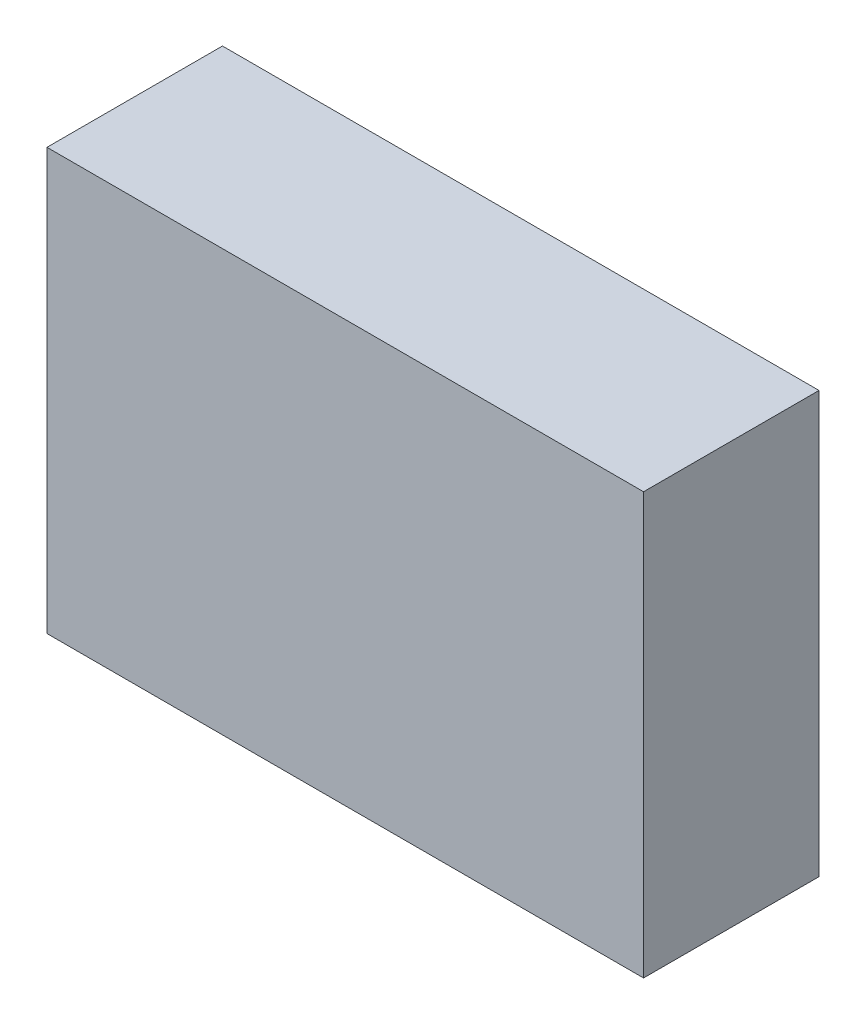
ISO-10303-21;
HEADER;
FILE_DESCRIPTION(('STEP AP214'),'2;1');
FILE_NAME('part.step','',(''),(''),'','','');
FILE_SCHEMA(('AUTOMOTIVE_DESIGN { 1 0 10303 214 1 1 1 1 }'));
ENDSEC;
DATA;
#1=APPLICATION_CONTEXT('core data for automotive mechanical design processes');
#2=APPLICATION_PROTOCOL_DEFINITION('international standard','automotive_design',2000,#1);
#3=PRODUCT_CONTEXT('',#1,'mechanical');
#4=PRODUCT('Part','Part','',(#3));
#5=PRODUCT_RELATED_PRODUCT_CATEGORY('part','',(#4));
#6=PRODUCT_DEFINITION_FORMATION('','',#4);
#7=PRODUCT_DEFINITION_CONTEXT('part definition',#1,'design');
#8=PRODUCT_DEFINITION('design','',#6,#7);
#9=PRODUCT_DEFINITION_SHAPE('','',#8);
#10=(LENGTH_UNIT() NAMED_UNIT(*) SI_UNIT(.MILLI.,.METRE.));
#11=(NAMED_UNIT(*) PLANE_ANGLE_UNIT() SI_UNIT($,.RADIAN.));
#12=(NAMED_UNIT(*) SI_UNIT($,.STERADIAN.) SOLID_ANGLE_UNIT());
#13=UNCERTAINTY_MEASURE_WITH_UNIT(LENGTH_MEASURE(1.E-05),#10,'distance_accuracy_value','');
#14=(GEOMETRIC_REPRESENTATION_CONTEXT(3) GLOBAL_UNCERTAINTY_ASSIGNED_CONTEXT((#13)) GLOBAL_UNIT_ASSIGNED_CONTEXT((#10,
#11,#12)) REPRESENTATION_CONTEXT('',''));
#15=CARTESIAN_POINT('',(0.,0.,0.));
#16=DIRECTION('',(0.,0.,1.));
#17=DIRECTION('',(1.,0.,0.));
#18=AXIS2_PLACEMENT_3D('',#15,#16,#17);
#19=CARTESIAN_POINT('',(2.58,1.13,0.));
#20=DIRECTION('',(1.,0.,0.));
#21=DIRECTION('',(0.,0.,1.));
#22=AXIS2_PLACEMENT_3D('',#19,#20,#21);
#23=PLANE('',#22);
#24=DIRECTION('',(0.,1.,0.));
#25=VECTOR('',#24,1.);
#26=CARTESIAN_POINT('',(2.58,1.13,0.1));
#27=LINE('',#26,#25);
#28=CARTESIAN_POINT('',(2.58,1.13,0.1));
#29=VERTEX_POINT('',#28);
#30=CARTESIAN_POINT('',(2.58,1.37,0.1));
#31=VERTEX_POINT('',#30);
#32=EDGE_CURVE('E11',#29,#31,#27,.T.);
#33=ORIENTED_EDGE('',*,*,#32,.T.);
#34=DIRECTION('',(0.,0.,1.));
#35=VECTOR('',#34,1.);
#36=CARTESIAN_POINT('',(2.58,1.37,0.));
#37=LINE('',#36,#35);
#38=CARTESIAN_POINT('',(2.58,1.37,0.));
#39=VERTEX_POINT('',#38);
#40=EDGE_CURVE('E24',#39,#31,#37,.T.);
#41=ORIENTED_EDGE('',*,*,#40,.F.);
#42=DIRECTION('',(0.,1.,0.));
#43=VECTOR('',#42,1.);
#44=CARTESIAN_POINT('',(2.58,1.13,0.));
#45=LINE('',#44,#43);
#46=CARTESIAN_POINT('',(2.58,1.13,0.));
#47=VERTEX_POINT('',#46);
#48=EDGE_CURVE('E86',#47,#39,#45,.T.);
#49=ORIENTED_EDGE('',*,*,#48,.F.);
#50=DIRECTION('',(0.,0.,1.));
#51=VECTOR('',#50,1.);
#52=CARTESIAN_POINT('',(2.58,1.13,0.));
#53=LINE('',#52,#51);
#54=EDGE_CURVE('E36',#47,#29,#53,.T.);
#55=ORIENTED_EDGE('',*,*,#54,.T.);
#56=EDGE_LOOP('',(#33,#41,#49,#55));
#57=FACE_BOUND('',#56,.T.);
#58=ADVANCED_FACE('F17',(#57),#23,.F.);
#59=CARTESIAN_POINT('',(2.92,1.13,0.));
#60=DIRECTION('',(1.,0.,0.));
#61=DIRECTION('',(0.,0.,1.));
#62=AXIS2_PLACEMENT_3D('',#59,#60,#61);
#63=PLANE('',#62);
#64=DIRECTION('',(0.,0.,1.));
#65=VECTOR('',#64,1.);
#66=CARTESIAN_POINT('',(2.92,1.13,0.));
#67=LINE('',#66,#65);
#68=CARTESIAN_POINT('',(2.92,1.13,0.));
#69=VERTEX_POINT('',#68);
#70=CARTESIAN_POINT('',(2.92,1.13,0.1));
#71=VERTEX_POINT('',#70);
#72=EDGE_CURVE('E83',#69,#71,#67,.T.);
#73=ORIENTED_EDGE('',*,*,#72,.F.);
#74=DIRECTION('',(0.,1.,0.));
#75=VECTOR('',#74,1.);
#76=CARTESIAN_POINT('',(2.92,1.13,0.));
#77=LINE('',#76,#75);
#78=CARTESIAN_POINT('',(2.92,1.37,0.));
#79=VERTEX_POINT('',#78);
#80=EDGE_CURVE('E63',#69,#79,#77,.T.);
#81=ORIENTED_EDGE('',*,*,#80,.T.);
#82=DIRECTION('',(0.,0.,1.));
#83=VECTOR('',#82,1.);
#84=CARTESIAN_POINT('',(2.92,1.37,0.));
#85=LINE('',#84,#83);
#86=CARTESIAN_POINT('',(2.92,1.37,0.1));
#87=VERTEX_POINT('',#86);
#88=EDGE_CURVE('E57',#79,#87,#85,.T.);
#89=ORIENTED_EDGE('',*,*,#88,.T.);
#90=DIRECTION('',(0.,1.,0.));
#91=VECTOR('',#90,1.);
#92=CARTESIAN_POINT('',(2.92,1.13,0.1));
#93=LINE('',#92,#91);
#94=EDGE_CURVE('E60',#71,#87,#93,.T.);
#95=ORIENTED_EDGE('',*,*,#94,.F.);
#96=EDGE_LOOP('',(#73,#81,#89,#95));
#97=FACE_BOUND('',#96,.T.);
#98=ADVANCED_FACE('F59',(#97),#63,.T.);
#99=CARTESIAN_POINT('',(2.58,1.13,0.));
#100=DIRECTION('',(0.,1.,0.));
#101=DIRECTION('',(0.,0.,1.));
#102=AXIS2_PLACEMENT_3D('',#99,#100,#101);
#103=PLANE('',#102);
#104=ORIENTED_EDGE('',*,*,#72,.T.);
#105=DIRECTION('',(1.,0.,0.));
#106=VECTOR('',#105,1.);
#107=CARTESIAN_POINT('',(2.58,1.13,0.1));
#108=LINE('',#107,#106);
#109=EDGE_CURVE('E71',#29,#71,#108,.T.);
#110=ORIENTED_EDGE('',*,*,#109,.F.);
#111=ORIENTED_EDGE('',*,*,#54,.F.);
#112=DIRECTION('',(1.,0.,0.));
#113=VECTOR('',#112,1.);
#114=CARTESIAN_POINT('',(2.58,1.13,0.));
#115=LINE('',#114,#113);
#116=EDGE_CURVE('E76',#47,#69,#115,.T.);
#117=ORIENTED_EDGE('',*,*,#116,.T.);
#118=EDGE_LOOP('',(#104,#110,#111,#117));
#119=FACE_BOUND('',#118,.T.);
#120=ADVANCED_FACE('F91',(#119),#103,.F.);
#121=CARTESIAN_POINT('',(2.58,1.37,0.));
#122=DIRECTION('',(0.,1.,0.));
#123=DIRECTION('',(0.,0.,1.));
#124=AXIS2_PLACEMENT_3D('',#121,#122,#123);
#125=PLANE('',#124);
#126=DIRECTION('',(1.,0.,0.));
#127=VECTOR('',#126,1.);
#128=CARTESIAN_POINT('',(2.58,1.37,0.));
#129=LINE('',#128,#127);
#130=EDGE_CURVE('E74',#39,#79,#129,.T.);
#131=ORIENTED_EDGE('',*,*,#130,.F.);
#132=ORIENTED_EDGE('',*,*,#40,.T.);
#133=DIRECTION('',(1.,0.,0.));
#134=VECTOR('',#133,1.);
#135=CARTESIAN_POINT('',(2.58,1.37,0.1));
#136=LINE('',#135,#134);
#137=EDGE_CURVE('E69',#31,#87,#136,.T.);
#138=ORIENTED_EDGE('',*,*,#137,.T.);
#139=ORIENTED_EDGE('',*,*,#88,.F.);
#140=EDGE_LOOP('',(#131,#132,#138,#139));
#141=FACE_BOUND('',#140,.T.);
#142=ADVANCED_FACE('F73',(#141),#125,.T.);
#143=CARTESIAN_POINT('',(2.58,1.13,0.));
#144=DIRECTION('',(0.,0.,1.));
#145=DIRECTION('',(1.,0.,0.));
#146=AXIS2_PLACEMENT_3D('',#143,#144,#145);
#147=PLANE('',#146);
#148=ORIENTED_EDGE('',*,*,#130,.T.);
#149=ORIENTED_EDGE('',*,*,#80,.F.);
#150=ORIENTED_EDGE('',*,*,#116,.F.);
#151=ORIENTED_EDGE('',*,*,#48,.T.);
#152=EDGE_LOOP('',(#148,#149,#150,#151));
#153=FACE_BOUND('',#152,.T.);
#154=ADVANCED_FACE('F89',(#153),#147,.F.);
#155=CARTESIAN_POINT('',(2.58,1.13,0.1));
#156=DIRECTION('',(0.,0.,1.));
#157=DIRECTION('',(1.,0.,0.));
#158=AXIS2_PLACEMENT_3D('',#155,#156,#157);
#159=PLANE('',#158);
#160=ORIENTED_EDGE('',*,*,#32,.F.);
#161=ORIENTED_EDGE('',*,*,#109,.T.);
#162=ORIENTED_EDGE('',*,*,#94,.T.);
#163=ORIENTED_EDGE('',*,*,#137,.F.);
#164=EDGE_LOOP('',(#160,#161,#162,#163));
#165=FACE_BOUND('',#164,.T.);
#166=ADVANCED_FACE('F68',(#165),#159,.T.);
#167=CLOSED_SHELL('',(#58,#98,#120,#142,#154,#166));
#168=MANIFOLD_SOLID_BREP('B1',#167);
#169=ADVANCED_BREP_SHAPE_REPRESENTATION('',(#18,#168),#14);
#170=SHAPE_DEFINITION_REPRESENTATION(#9,#169);
ENDSEC;
END-ISO-10303-21;
